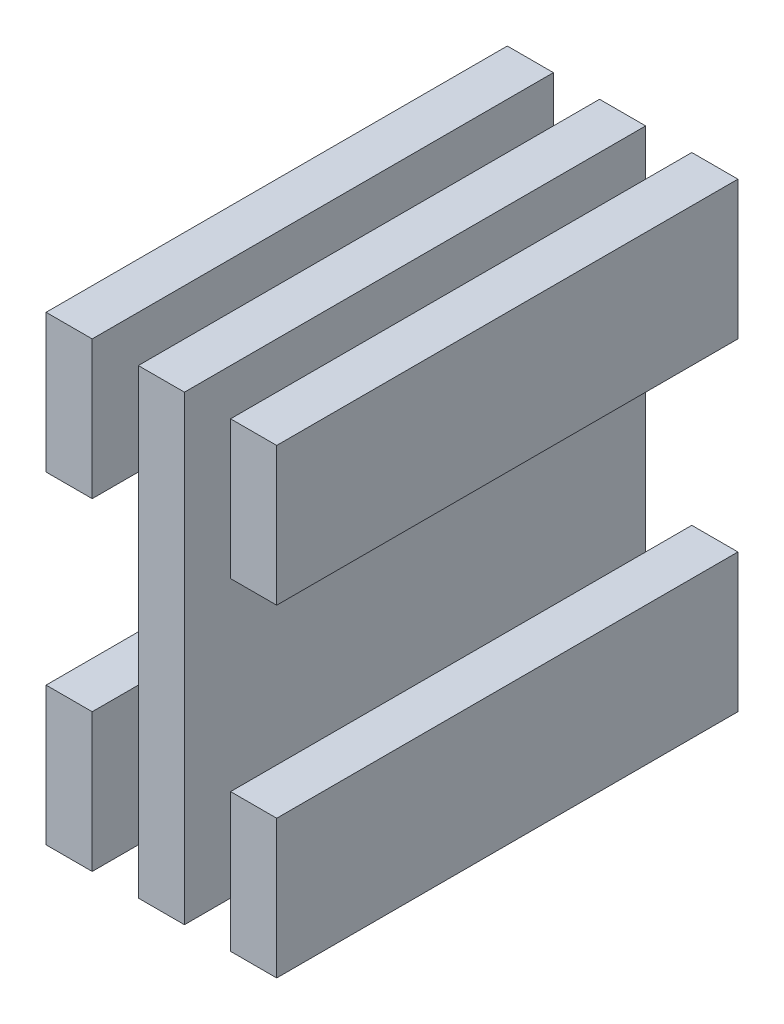
ISO-10303-21;
HEADER;
FILE_DESCRIPTION(('STEP AP214'),'2;1');
FILE_NAME('part.step','',(''),(''),'','','');
FILE_SCHEMA(('AUTOMOTIVE_DESIGN { 1 0 10303 214 1 1 1 1 }'));
ENDSEC;
DATA;
#1=APPLICATION_CONTEXT('core data for automotive mechanical design processes');
#2=APPLICATION_PROTOCOL_DEFINITION('international standard','automotive_design',2000,#1);
#3=PRODUCT_CONTEXT('',#1,'mechanical');
#4=PRODUCT('Part','Part','',(#3));
#5=PRODUCT_RELATED_PRODUCT_CATEGORY('part','',(#4));
#6=PRODUCT_DEFINITION_FORMATION('','',#4);
#7=PRODUCT_DEFINITION_CONTEXT('part definition',#1,'design');
#8=PRODUCT_DEFINITION('design','',#6,#7);
#9=PRODUCT_DEFINITION_SHAPE('','',#8);
#10=(LENGTH_UNIT() NAMED_UNIT(*) SI_UNIT(.MILLI.,.METRE.));
#11=(NAMED_UNIT(*) PLANE_ANGLE_UNIT() SI_UNIT($,.RADIAN.));
#12=(NAMED_UNIT(*) SI_UNIT($,.STERADIAN.) SOLID_ANGLE_UNIT());
#13=UNCERTAINTY_MEASURE_WITH_UNIT(LENGTH_MEASURE(1.E-05),#10,'distance_accuracy_value','');
#14=(GEOMETRIC_REPRESENTATION_CONTEXT(3) GLOBAL_UNCERTAINTY_ASSIGNED_CONTEXT((#13)) GLOBAL_UNIT_ASSIGNED_CONTEXT((#10,
#11,#12)) REPRESENTATION_CONTEXT('',''));
#15=CARTESIAN_POINT('',(0.,0.,0.));
#16=DIRECTION('',(0.,0.,1.));
#17=DIRECTION('',(1.,0.,0.));
#18=AXIS2_PLACEMENT_3D('',#15,#16,#17);
#19=CARTESIAN_POINT('',(0.,50.,-50.));
#20=DIRECTION('',(1.,0.,0.));
#21=DIRECTION('',(0.,0.,-1.));
#22=AXIS2_PLACEMENT_3D('',#19,#20,#21);
#23=PLANE('',#22);
#24=DIRECTION('',(0.,-1.,0.));
#25=VECTOR('',#24,1.);
#26=CARTESIAN_POINT('',(0.,50.,0.));
#27=LINE('',#26,#25);
#28=CARTESIAN_POINT('',(0.,15.,0.));
#29=VERTEX_POINT('',#28);
#30=CARTESIAN_POINT('',(0.,0.,0.));
#31=VERTEX_POINT('',#30);
#32=EDGE_CURVE('E93',#29,#31,#27,.T.);
#33=ORIENTED_EDGE('',*,*,#32,.F.);
#34=DIRECTION('',(0.,0.,-1.));
#35=VECTOR('',#34,1.);
#36=CARTESIAN_POINT('',(0.,15.,0.));
#37=LINE('',#36,#35);
#38=CARTESIAN_POINT('',(0.,15.,-50.));
#39=VERTEX_POINT('',#38);
#40=EDGE_CURVE('E82',#29,#39,#37,.T.);
#41=ORIENTED_EDGE('',*,*,#40,.T.);
#42=DIRECTION('',(0.,-1.,0.));
#43=VECTOR('',#42,1.);
#44=CARTESIAN_POINT('',(0.,50.,-50.));
#45=LINE('',#44,#43);
#46=CARTESIAN_POINT('',(0.,0.,-50.));
#47=VERTEX_POINT('',#46);
#48=EDGE_CURVE('E49',#39,#47,#45,.T.);
#49=ORIENTED_EDGE('',*,*,#48,.T.);
#50=DIRECTION('',(0.,0.,1.));
#51=VECTOR('',#50,1.);
#52=CARTESIAN_POINT('',(0.,0.,-50.));
#53=LINE('',#52,#51);
#54=EDGE_CURVE('E98',#47,#31,#53,.T.);
#55=ORIENTED_EDGE('',*,*,#54,.T.);
#56=EDGE_LOOP('',(#33,#41,#49,#55));
#57=FACE_BOUND('',#56,.T.);
#58=ADVANCED_FACE('F46',(#57),#23,.F.);
#59=CARTESIAN_POINT('',(0.,50.,0.));
#60=DIRECTION('',(0.,0.,-1.));
#61=DIRECTION('',(-1.,0.,0.));
#62=AXIS2_PLACEMENT_3D('',#59,#60,#61);
#63=PLANE('',#62);
#64=DIRECTION('',(0.,-1.,0.));
#65=VECTOR('',#64,1.);
#66=CARTESIAN_POINT('',(5.,50.,0.));
#67=LINE('',#66,#65);
#68=CARTESIAN_POINT('',(5.,15.,0.));
#69=VERTEX_POINT('',#68);
#70=CARTESIAN_POINT('',(5.,0.,0.));
#71=VERTEX_POINT('',#70);
#72=EDGE_CURVE('E95',#69,#71,#67,.T.);
#73=ORIENTED_EDGE('',*,*,#72,.F.);
#74=DIRECTION('',(1.,0.,0.));
#75=VECTOR('',#74,1.);
#76=CARTESIAN_POINT('',(0.,15.,0.));
#77=LINE('',#76,#75);
#78=EDGE_CURVE('E12',#29,#69,#77,.T.);
#79=ORIENTED_EDGE('',*,*,#78,.F.);
#80=ORIENTED_EDGE('',*,*,#32,.T.);
#81=DIRECTION('',(1.,0.,0.));
#82=VECTOR('',#81,1.);
#83=CARTESIAN_POINT('',(0.,0.,0.));
#84=LINE('',#83,#82);
#85=EDGE_CURVE('E99',#31,#71,#84,.T.);
#86=ORIENTED_EDGE('',*,*,#85,.T.);
#87=EDGE_LOOP('',(#73,#79,#80,#86));
#88=FACE_BOUND('',#87,.T.);
#89=ADVANCED_FACE('F91',(#88),#63,.F.);
#90=CARTESIAN_POINT('',(5.,50.,-50.));
#91=DIRECTION('',(-1.,0.,0.));
#92=DIRECTION('',(0.,0.,1.));
#93=AXIS2_PLACEMENT_3D('',#90,#91,#92);
#94=PLANE('',#93);
#95=DIRECTION('',(0.,-1.,0.));
#96=VECTOR('',#95,1.);
#97=CARTESIAN_POINT('',(5.,50.,-50.));
#98=LINE('',#97,#96);
#99=CARTESIAN_POINT('',(5.,15.,-50.));
#100=VERTEX_POINT('',#99);
#101=CARTESIAN_POINT('',(5.,0.,-50.));
#102=VERTEX_POINT('',#101);
#103=EDGE_CURVE('E106',#100,#102,#98,.T.);
#104=ORIENTED_EDGE('',*,*,#103,.F.);
#105=DIRECTION('',(0.,0.,1.));
#106=VECTOR('',#105,1.);
#107=CARTESIAN_POINT('',(5.,15.,-50.));
#108=LINE('',#107,#106);
#109=EDGE_CURVE('E63',#100,#69,#108,.T.);
#110=ORIENTED_EDGE('',*,*,#109,.T.);
#111=ORIENTED_EDGE('',*,*,#72,.T.);
#112=DIRECTION('',(0.,0.,-1.));
#113=VECTOR('',#112,1.);
#114=CARTESIAN_POINT('',(5.,0.,-50.));
#115=LINE('',#114,#113);
#116=EDGE_CURVE('E105',#71,#102,#115,.T.);
#117=ORIENTED_EDGE('',*,*,#116,.T.);
#118=EDGE_LOOP('',(#104,#110,#111,#117));
#119=FACE_BOUND('',#118,.T.);
#120=ADVANCED_FACE('F115',(#119),#94,.F.);
#121=CARTESIAN_POINT('',(0.,50.,-50.));
#122=DIRECTION('',(0.,0.,1.));
#123=DIRECTION('',(1.,0.,0.));
#124=AXIS2_PLACEMENT_3D('',#121,#122,#123);
#125=PLANE('',#124);
#126=ORIENTED_EDGE('',*,*,#48,.F.);
#127=DIRECTION('',(1.,0.,0.));
#128=VECTOR('',#127,1.);
#129=CARTESIAN_POINT('',(0.,15.,-50.));
#130=LINE('',#129,#128);
#131=EDGE_CURVE('E80',#39,#100,#130,.T.);
#132=ORIENTED_EDGE('',*,*,#131,.T.);
#133=ORIENTED_EDGE('',*,*,#103,.T.);
#134=DIRECTION('',(-1.,0.,0.));
#135=VECTOR('',#134,1.);
#136=CARTESIAN_POINT('',(0.,0.,-50.));
#137=LINE('',#136,#135);
#138=EDGE_CURVE('E55',#102,#47,#137,.T.);
#139=ORIENTED_EDGE('',*,*,#138,.T.);
#140=EDGE_LOOP('',(#126,#132,#133,#139));
#141=FACE_BOUND('',#140,.T.);
#142=ADVANCED_FACE('F120',(#141),#125,.F.);
#143=CARTESIAN_POINT('',(0.,0.,0.));
#144=DIRECTION('',(0.,1.,0.));
#145=DIRECTION('',(0.,0.,1.));
#146=AXIS2_PLACEMENT_3D('',#143,#144,#145);
#147=PLANE('',#146);
#148=ORIENTED_EDGE('',*,*,#54,.F.);
#149=ORIENTED_EDGE('',*,*,#138,.F.);
#150=ORIENTED_EDGE('',*,*,#116,.F.);
#151=ORIENTED_EDGE('',*,*,#85,.F.);
#152=EDGE_LOOP('',(#148,#149,#150,#151));
#153=FACE_BOUND('',#152,.T.);
#154=ADVANCED_FACE('F119',(#153),#147,.F.);
#155=CARTESIAN_POINT('',(0.,15.,0.));
#156=DIRECTION('',(0.,-1.,0.));
#157=DIRECTION('',(0.,0.,-1.));
#158=AXIS2_PLACEMENT_3D('',#155,#156,#157);
#159=PLANE('',#158);
#160=ORIENTED_EDGE('',*,*,#131,.F.);
#161=ORIENTED_EDGE('',*,*,#40,.F.);
#162=ORIENTED_EDGE('',*,*,#78,.T.);
#163=ORIENTED_EDGE('',*,*,#109,.F.);
#164=EDGE_LOOP('',(#160,#161,#162,#163));
#165=FACE_BOUND('',#164,.T.);
#166=ADVANCED_FACE('F84',(#165),#159,.F.);
#167=CLOSED_SHELL('',(#58,#89,#120,#142,#154,#166));
#168=MANIFOLD_SOLID_BREP('B2',#167);
#169=CARTESIAN_POINT('',(20.,50.,-50.));
#170=DIRECTION('',(0.,0.,1.));
#171=DIRECTION('',(1.,0.,0.));
#172=AXIS2_PLACEMENT_3D('',#169,#170,#171);
#173=PLANE('',#172);
#174=DIRECTION('',(0.,-1.,0.));
#175=VECTOR('',#174,1.);
#176=CARTESIAN_POINT('',(20.,50.,-50.));
#177=LINE('',#176,#175);
#178=CARTESIAN_POINT('',(20.,15.,-50.));
#179=VERTEX_POINT('',#178);
#180=CARTESIAN_POINT('',(20.,0.,-50.));
#181=VERTEX_POINT('',#180);
#182=EDGE_CURVE('E225',#179,#181,#177,.T.);
#183=ORIENTED_EDGE('',*,*,#182,.F.);
#184=DIRECTION('',(1.,0.,0.));
#185=VECTOR('',#184,1.);
#186=CARTESIAN_POINT('',(0.,15.,-50.));
#187=LINE('',#186,#185);
#188=CARTESIAN_POINT('',(25.,15.,-50.));
#189=VERTEX_POINT('',#188);
#190=EDGE_CURVE('E217',#179,#189,#187,.T.);
#191=ORIENTED_EDGE('',*,*,#190,.T.);
#192=DIRECTION('',(0.,-1.,0.));
#193=VECTOR('',#192,1.);
#194=CARTESIAN_POINT('',(25.,50.,-50.));
#195=LINE('',#194,#193);
#196=CARTESIAN_POINT('',(25.,0.,-50.));
#197=VERTEX_POINT('',#196);
#198=EDGE_CURVE('E183',#189,#197,#195,.T.);
#199=ORIENTED_EDGE('',*,*,#198,.T.);
#200=DIRECTION('',(-1.,0.,0.));
#201=VECTOR('',#200,1.);
#202=CARTESIAN_POINT('',(20.,0.,-50.));
#203=LINE('',#202,#201);
#204=EDGE_CURVE('E231',#197,#181,#203,.T.);
#205=ORIENTED_EDGE('',*,*,#204,.T.);
#206=EDGE_LOOP('',(#183,#191,#199,#205));
#207=FACE_BOUND('',#206,.T.);
#208=ADVANCED_FACE('F180',(#207),#173,.F.);
#209=CARTESIAN_POINT('',(20.,50.,-50.));
#210=DIRECTION('',(1.,0.,0.));
#211=DIRECTION('',(0.,0.,-1.));
#212=AXIS2_PLACEMENT_3D('',#209,#210,#211);
#213=PLANE('',#212);
#214=DIRECTION('',(0.,-1.,0.));
#215=VECTOR('',#214,1.);
#216=CARTESIAN_POINT('',(20.,50.,0.));
#217=LINE('',#216,#215);
#218=CARTESIAN_POINT('',(20.,15.,0.));
#219=VERTEX_POINT('',#218);
#220=CARTESIAN_POINT('',(20.,0.,0.));
#221=VERTEX_POINT('',#220);
#222=EDGE_CURVE('E240',#219,#221,#217,.T.);
#223=ORIENTED_EDGE('',*,*,#222,.F.);
#224=DIRECTION('',(0.,0.,-1.));
#225=VECTOR('',#224,1.);
#226=CARTESIAN_POINT('',(20.,15.,-50.));
#227=LINE('',#226,#225);
#228=EDGE_CURVE('E197',#219,#179,#227,.T.);
#229=ORIENTED_EDGE('',*,*,#228,.T.);
#230=ORIENTED_EDGE('',*,*,#182,.T.);
#231=DIRECTION('',(0.,0.,1.));
#232=VECTOR('',#231,1.);
#233=CARTESIAN_POINT('',(20.,0.,-50.));
#234=LINE('',#233,#232);
#235=EDGE_CURVE('E235',#181,#221,#234,.T.);
#236=ORIENTED_EDGE('',*,*,#235,.T.);
#237=EDGE_LOOP('',(#223,#229,#230,#236));
#238=FACE_BOUND('',#237,.T.);
#239=ADVANCED_FACE('F254',(#238),#213,.F.);
#240=CARTESIAN_POINT('',(20.,50.,0.));
#241=DIRECTION('',(0.,0.,-1.));
#242=DIRECTION('',(-1.,0.,0.));
#243=AXIS2_PLACEMENT_3D('',#240,#241,#242);
#244=PLANE('',#243);
#245=DIRECTION('',(0.,-1.,0.));
#246=VECTOR('',#245,1.);
#247=CARTESIAN_POINT('',(25.,50.,0.));
#248=LINE('',#247,#246);
#249=CARTESIAN_POINT('',(25.,15.,0.));
#250=VERTEX_POINT('',#249);
#251=CARTESIAN_POINT('',(25.,0.,0.));
#252=VERTEX_POINT('',#251);
#253=EDGE_CURVE('E242',#250,#252,#248,.T.);
#254=ORIENTED_EDGE('',*,*,#253,.F.);
#255=DIRECTION('',(1.,0.,0.));
#256=VECTOR('',#255,1.);
#257=CARTESIAN_POINT('',(0.,15.,0.));
#258=LINE('',#257,#256);
#259=EDGE_CURVE('E189',#219,#250,#258,.T.);
#260=ORIENTED_EDGE('',*,*,#259,.F.);
#261=ORIENTED_EDGE('',*,*,#222,.T.);
#262=DIRECTION('',(1.,0.,0.));
#263=VECTOR('',#262,1.);
#264=CARTESIAN_POINT('',(20.,0.,0.));
#265=LINE('',#264,#263);
#266=EDGE_CURVE('E241',#221,#252,#265,.T.);
#267=ORIENTED_EDGE('',*,*,#266,.T.);
#268=EDGE_LOOP('',(#254,#260,#261,#267));
#269=FACE_BOUND('',#268,.T.);
#270=ADVANCED_FACE('F247',(#269),#244,.F.);
#271=CARTESIAN_POINT('',(25.,50.,-50.));
#272=DIRECTION('',(-1.,0.,0.));
#273=DIRECTION('',(0.,0.,1.));
#274=AXIS2_PLACEMENT_3D('',#271,#272,#273);
#275=PLANE('',#274);
#276=ORIENTED_EDGE('',*,*,#198,.F.);
#277=DIRECTION('',(0.,0.,-1.));
#278=VECTOR('',#277,1.);
#279=CARTESIAN_POINT('',(25.,15.,0.));
#280=LINE('',#279,#278);
#281=EDGE_CURVE('E44',#250,#189,#280,.T.);
#282=ORIENTED_EDGE('',*,*,#281,.F.);
#283=ORIENTED_EDGE('',*,*,#253,.T.);
#284=DIRECTION('',(0.,0.,-1.));
#285=VECTOR('',#284,1.);
#286=CARTESIAN_POINT('',(25.,0.,-50.));
#287=LINE('',#286,#285);
#288=EDGE_CURVE('E229',#252,#197,#287,.T.);
#289=ORIENTED_EDGE('',*,*,#288,.T.);
#290=EDGE_LOOP('',(#276,#282,#283,#289));
#291=FACE_BOUND('',#290,.T.);
#292=ADVANCED_FACE('F227',(#291),#275,.F.);
#293=CARTESIAN_POINT('',(0.,0.,0.));
#294=DIRECTION('',(0.,-1.,0.));
#295=DIRECTION('',(0.,0.,-1.));
#296=AXIS2_PLACEMENT_3D('',#293,#294,#295);
#297=PLANE('',#296);
#298=ORIENTED_EDGE('',*,*,#204,.F.);
#299=ORIENTED_EDGE('',*,*,#288,.F.);
#300=ORIENTED_EDGE('',*,*,#266,.F.);
#301=ORIENTED_EDGE('',*,*,#235,.F.);
#302=EDGE_LOOP('',(#298,#299,#300,#301));
#303=FACE_BOUND('',#302,.T.);
#304=ADVANCED_FACE('F252',(#303),#297,.T.);
#305=CARTESIAN_POINT('',(0.,15.,0.));
#306=DIRECTION('',(0.,-1.,0.));
#307=DIRECTION('',(0.,0.,-1.));
#308=AXIS2_PLACEMENT_3D('',#305,#306,#307);
#309=PLANE('',#308);
#310=ORIENTED_EDGE('',*,*,#259,.T.);
#311=ORIENTED_EDGE('',*,*,#281,.T.);
#312=ORIENTED_EDGE('',*,*,#190,.F.);
#313=ORIENTED_EDGE('',*,*,#228,.F.);
#314=EDGE_LOOP('',(#310,#311,#312,#313));
#315=FACE_BOUND('',#314,.T.);
#316=ADVANCED_FACE('F216',(#315),#309,.F.);
#317=CLOSED_SHELL('',(#208,#239,#270,#292,#304,#316));
#318=MANIFOLD_SOLID_BREP('B6',#317);
#319=CARTESIAN_POINT('',(0.,50.,0.));
#320=DIRECTION('',(0.,-1.,0.));
#321=DIRECTION('',(0.,0.,-1.));
#322=AXIS2_PLACEMENT_3D('',#319,#320,#321);
#323=PLANE('',#322);
#324=DIRECTION('',(-1.,0.,0.));
#325=VECTOR('',#324,1.);
#326=CARTESIAN_POINT('',(20.,50.,-50.));
#327=LINE('',#326,#325);
#328=CARTESIAN_POINT('',(25.,50.,-50.));
#329=VERTEX_POINT('',#328);
#330=CARTESIAN_POINT('',(20.,50.,-50.));
#331=VERTEX_POINT('',#330);
#332=EDGE_CURVE('E381',#329,#331,#327,.T.);
#333=ORIENTED_EDGE('',*,*,#332,.T.);
#334=DIRECTION('',(0.,0.,1.));
#335=VECTOR('',#334,1.);
#336=CARTESIAN_POINT('',(20.,50.,-50.));
#337=LINE('',#336,#335);
#338=CARTESIAN_POINT('',(20.,50.,0.));
#339=VERTEX_POINT('',#338);
#340=EDGE_CURVE('E379',#331,#339,#337,.T.);
#341=ORIENTED_EDGE('',*,*,#340,.T.);
#342=DIRECTION('',(1.,0.,0.));
#343=VECTOR('',#342,1.);
#344=CARTESIAN_POINT('',(20.,50.,0.));
#345=LINE('',#344,#343);
#346=CARTESIAN_POINT('',(25.,50.,0.));
#347=VERTEX_POINT('',#346);
#348=EDGE_CURVE('E377',#339,#347,#345,.T.);
#349=ORIENTED_EDGE('',*,*,#348,.T.);
#350=DIRECTION('',(0.,0.,-1.));
#351=VECTOR('',#350,1.);
#352=CARTESIAN_POINT('',(25.,50.,-50.));
#353=LINE('',#352,#351);
#354=EDGE_CURVE('E337',#347,#329,#353,.T.);
#355=ORIENTED_EDGE('',*,*,#354,.T.);
#356=EDGE_LOOP('',(#333,#341,#349,#355));
#357=FACE_BOUND('',#356,.T.);
#358=ADVANCED_FACE('F314',(#357),#323,.F.);
#359=CARTESIAN_POINT('',(25.,50.,-50.));
#360=DIRECTION('',(-1.,0.,0.));
#361=DIRECTION('',(0.,0.,1.));
#362=AXIS2_PLACEMENT_3D('',#359,#360,#361);
#363=PLANE('',#362);
#364=DIRECTION('',(0.,-1.,0.));
#365=VECTOR('',#364,1.);
#366=CARTESIAN_POINT('',(25.,50.,0.));
#367=LINE('',#366,#365);
#368=CARTESIAN_POINT('',(25.,35.,0.));
#369=VERTEX_POINT('',#368);
#370=EDGE_CURVE('E367',#347,#369,#367,.T.);
#371=ORIENTED_EDGE('',*,*,#370,.T.);
#372=DIRECTION('',(0.,0.,1.));
#373=VECTOR('',#372,1.);
#374=CARTESIAN_POINT('',(25.,35.,0.));
#375=LINE('',#374,#373);
#376=CARTESIAN_POINT('',(25.,35.,-50.));
#377=VERTEX_POINT('',#376);
#378=EDGE_CURVE('E353',#377,#369,#375,.T.);
#379=ORIENTED_EDGE('',*,*,#378,.F.);
#380=DIRECTION('',(0.,-1.,0.));
#381=VECTOR('',#380,1.);
#382=CARTESIAN_POINT('',(25.,50.,-50.));
#383=LINE('',#382,#381);
#384=EDGE_CURVE('E372',#329,#377,#383,.T.);
#385=ORIENTED_EDGE('',*,*,#384,.F.);
#386=ORIENTED_EDGE('',*,*,#354,.F.);
#387=EDGE_LOOP('',(#371,#379,#385,#386));
#388=FACE_BOUND('',#387,.T.);
#389=ADVANCED_FACE('F371',(#388),#363,.F.);
#390=CARTESIAN_POINT('',(20.,50.,0.));
#391=DIRECTION('',(0.,0.,-1.));
#392=DIRECTION('',(-1.,0.,0.));
#393=AXIS2_PLACEMENT_3D('',#390,#391,#392);
#394=PLANE('',#393);
#395=DIRECTION('',(0.,-1.,0.));
#396=VECTOR('',#395,1.);
#397=CARTESIAN_POINT('',(20.,50.,0.));
#398=LINE('',#397,#396);
#399=CARTESIAN_POINT('',(20.,35.,0.));
#400=VERTEX_POINT('',#399);
#401=EDGE_CURVE('E322',#339,#400,#398,.T.);
#402=ORIENTED_EDGE('',*,*,#401,.T.);
#403=DIRECTION('',(1.,0.,0.));
#404=VECTOR('',#403,1.);
#405=CARTESIAN_POINT('',(0.,35.,0.));
#406=LINE('',#405,#404);
#407=EDGE_CURVE('E356',#400,#369,#406,.T.);
#408=ORIENTED_EDGE('',*,*,#407,.T.);
#409=ORIENTED_EDGE('',*,*,#370,.F.);
#410=ORIENTED_EDGE('',*,*,#348,.F.);
#411=EDGE_LOOP('',(#402,#408,#409,#410));
#412=FACE_BOUND('',#411,.T.);
#413=ADVANCED_FACE('F365',(#412),#394,.F.);
#414=CARTESIAN_POINT('',(20.,50.,-50.));
#415=DIRECTION('',(1.,0.,0.));
#416=DIRECTION('',(0.,0.,-1.));
#417=AXIS2_PLACEMENT_3D('',#414,#415,#416);
#418=PLANE('',#417);
#419=DIRECTION('',(0.,-1.,0.));
#420=VECTOR('',#419,1.);
#421=CARTESIAN_POINT('',(20.,50.,-50.));
#422=LINE('',#421,#420);
#423=CARTESIAN_POINT('',(20.,35.,-50.));
#424=VERTEX_POINT('',#423);
#425=EDGE_CURVE('E178',#331,#424,#422,.T.);
#426=ORIENTED_EDGE('',*,*,#425,.T.);
#427=DIRECTION('',(0.,0.,1.));
#428=VECTOR('',#427,1.);
#429=CARTESIAN_POINT('',(20.,35.,-50.));
#430=LINE('',#429,#428);
#431=EDGE_CURVE('E369',#424,#400,#430,.T.);
#432=ORIENTED_EDGE('',*,*,#431,.T.);
#433=ORIENTED_EDGE('',*,*,#401,.F.);
#434=ORIENTED_EDGE('',*,*,#340,.F.);
#435=EDGE_LOOP('',(#426,#432,#433,#434));
#436=FACE_BOUND('',#435,.T.);
#437=ADVANCED_FACE('F385',(#436),#418,.F.);
#438=CARTESIAN_POINT('',(20.,50.,-50.));
#439=DIRECTION('',(0.,0.,1.));
#440=DIRECTION('',(1.,0.,0.));
#441=AXIS2_PLACEMENT_3D('',#438,#439,#440);
#442=PLANE('',#441);
#443=ORIENTED_EDGE('',*,*,#384,.T.);
#444=DIRECTION('',(1.,0.,0.));
#445=VECTOR('',#444,1.);
#446=CARTESIAN_POINT('',(0.,35.,-50.));
#447=LINE('',#446,#445);
#448=EDGE_CURVE('E329',#424,#377,#447,.T.);
#449=ORIENTED_EDGE('',*,*,#448,.F.);
#450=ORIENTED_EDGE('',*,*,#425,.F.);
#451=ORIENTED_EDGE('',*,*,#332,.F.);
#452=EDGE_LOOP('',(#443,#449,#450,#451));
#453=FACE_BOUND('',#452,.T.);
#454=ADVANCED_FACE('F316',(#453),#442,.F.);
#455=CARTESIAN_POINT('',(0.,35.,0.));
#456=DIRECTION('',(0.,1.,0.));
#457=DIRECTION('',(0.,0.,1.));
#458=AXIS2_PLACEMENT_3D('',#455,#456,#457);
#459=PLANE('',#458);
#460=ORIENTED_EDGE('',*,*,#448,.T.);
#461=ORIENTED_EDGE('',*,*,#378,.T.);
#462=ORIENTED_EDGE('',*,*,#407,.F.);
#463=ORIENTED_EDGE('',*,*,#431,.F.);
#464=EDGE_LOOP('',(#460,#461,#462,#463));
#465=FACE_BOUND('',#464,.T.);
#466=ADVANCED_FACE('F355',(#465),#459,.F.);
#467=CLOSED_SHELL('',(#358,#389,#413,#437,#454,#466));
#468=MANIFOLD_SOLID_BREP('B38',#467);
#469=CARTESIAN_POINT('',(10.,50.,-50.));
#470=DIRECTION('',(0.,0.,1.));
#471=DIRECTION('',(1.,0.,0.));
#472=AXIS2_PLACEMENT_3D('',#469,#470,#471);
#473=PLANE('',#472);
#474=DIRECTION('',(-1.,0.,0.));
#475=VECTOR('',#474,1.);
#476=CARTESIAN_POINT('',(10.,0.,-50.));
#477=LINE('',#476,#475);
#478=CARTESIAN_POINT('',(15.,0.,-50.));
#479=VERTEX_POINT('',#478);
#480=CARTESIAN_POINT('',(10.,0.,-50.));
#481=VERTEX_POINT('',#480);
#482=EDGE_CURVE('E510',#479,#481,#477,.T.);
#483=ORIENTED_EDGE('',*,*,#482,.T.);
#484=DIRECTION('',(0.,-1.,0.));
#485=VECTOR('',#484,1.);
#486=CARTESIAN_POINT('',(10.,50.,-50.));
#487=LINE('',#486,#485);
#488=CARTESIAN_POINT('',(10.,50.,-50.));
#489=VERTEX_POINT('',#488);
#490=EDGE_CURVE('E312',#489,#481,#487,.T.);
#491=ORIENTED_EDGE('',*,*,#490,.F.);
#492=DIRECTION('',(-1.,0.,0.));
#493=VECTOR('',#492,1.);
#494=CARTESIAN_POINT('',(10.,50.,-50.));
#495=LINE('',#494,#493);
#496=CARTESIAN_POINT('',(15.,50.,-50.));
#497=VERTEX_POINT('',#496);
#498=EDGE_CURVE('E498',#497,#489,#495,.T.);
#499=ORIENTED_EDGE('',*,*,#498,.F.);
#500=DIRECTION('',(0.,-1.,0.));
#501=VECTOR('',#500,1.);
#502=CARTESIAN_POINT('',(15.,50.,-50.));
#503=LINE('',#502,#501);
#504=EDGE_CURVE('E506',#497,#479,#503,.T.);
#505=ORIENTED_EDGE('',*,*,#504,.T.);
#506=EDGE_LOOP('',(#483,#491,#499,#505));
#507=FACE_BOUND('',#506,.T.);
#508=ADVANCED_FACE('F447',(#507),#473,.F.);
#509=CARTESIAN_POINT('',(10.,50.,-50.));
#510=DIRECTION('',(1.,0.,0.));
#511=DIRECTION('',(0.,0.,-1.));
#512=AXIS2_PLACEMENT_3D('',#509,#510,#511);
#513=PLANE('',#512);
#514=DIRECTION('',(0.,0.,1.));
#515=VECTOR('',#514,1.);
#516=CARTESIAN_POINT('',(10.,0.,-50.));
#517=LINE('',#516,#515);
#518=CARTESIAN_POINT('',(10.,0.,0.));
#519=VERTEX_POINT('',#518);
#520=EDGE_CURVE('E502',#481,#519,#517,.T.);
#521=ORIENTED_EDGE('',*,*,#520,.T.);
#522=DIRECTION('',(0.,-1.,0.));
#523=VECTOR('',#522,1.);
#524=CARTESIAN_POINT('',(10.,50.,0.));
#525=LINE('',#524,#523);
#526=CARTESIAN_POINT('',(10.,50.,0.));
#527=VERTEX_POINT('',#526);
#528=EDGE_CURVE('E455',#527,#519,#525,.T.);
#529=ORIENTED_EDGE('',*,*,#528,.F.);
#530=DIRECTION('',(0.,0.,1.));
#531=VECTOR('',#530,1.);
#532=CARTESIAN_POINT('',(10.,50.,-50.));
#533=LINE('',#532,#531);
#534=EDGE_CURVE('E493',#489,#527,#533,.T.);
#535=ORIENTED_EDGE('',*,*,#534,.F.);
#536=ORIENTED_EDGE('',*,*,#490,.T.);
#537=EDGE_LOOP('',(#521,#529,#535,#536));
#538=FACE_BOUND('',#537,.T.);
#539=ADVANCED_FACE('F501',(#538),#513,.F.);
#540=CARTESIAN_POINT('',(10.,50.,0.));
#541=DIRECTION('',(0.,0.,-1.));
#542=DIRECTION('',(-1.,0.,0.));
#543=AXIS2_PLACEMENT_3D('',#540,#541,#542);
#544=PLANE('',#543);
#545=DIRECTION('',(1.,0.,0.));
#546=VECTOR('',#545,1.);
#547=CARTESIAN_POINT('',(10.,0.,0.));
#548=LINE('',#547,#546);
#549=CARTESIAN_POINT('',(15.,0.,0.));
#550=VERTEX_POINT('',#549);
#551=EDGE_CURVE('E480',#519,#550,#548,.T.);
#552=ORIENTED_EDGE('',*,*,#551,.T.);
#553=DIRECTION('',(0.,-1.,0.));
#554=VECTOR('',#553,1.);
#555=CARTESIAN_POINT('',(15.,50.,0.));
#556=LINE('',#555,#554);
#557=CARTESIAN_POINT('',(15.,50.,0.));
#558=VERTEX_POINT('',#557);
#559=EDGE_CURVE('E503',#558,#550,#556,.T.);
#560=ORIENTED_EDGE('',*,*,#559,.F.);
#561=DIRECTION('',(1.,0.,0.));
#562=VECTOR('',#561,1.);
#563=CARTESIAN_POINT('',(10.,50.,0.));
#564=LINE('',#563,#562);
#565=EDGE_CURVE('E496',#527,#558,#564,.T.);
#566=ORIENTED_EDGE('',*,*,#565,.F.);
#567=ORIENTED_EDGE('',*,*,#528,.T.);
#568=EDGE_LOOP('',(#552,#560,#566,#567));
#569=FACE_BOUND('',#568,.T.);
#570=ADVANCED_FACE('F504',(#569),#544,.F.);
#571=CARTESIAN_POINT('',(15.,50.,-50.));
#572=DIRECTION('',(-1.,0.,0.));
#573=DIRECTION('',(0.,0.,1.));
#574=AXIS2_PLACEMENT_3D('',#571,#572,#573);
#575=PLANE('',#574);
#576=DIRECTION('',(0.,0.,-1.));
#577=VECTOR('',#576,1.);
#578=CARTESIAN_POINT('',(15.,0.,-50.));
#579=LINE('',#578,#577);
#580=EDGE_CURVE('E486',#550,#479,#579,.T.);
#581=ORIENTED_EDGE('',*,*,#580,.T.);
#582=ORIENTED_EDGE('',*,*,#504,.F.);
#583=DIRECTION('',(0.,0.,-1.));
#584=VECTOR('',#583,1.);
#585=CARTESIAN_POINT('',(15.,50.,-50.));
#586=LINE('',#585,#584);
#587=EDGE_CURVE('E463',#558,#497,#586,.T.);
#588=ORIENTED_EDGE('',*,*,#587,.F.);
#589=ORIENTED_EDGE('',*,*,#559,.T.);
#590=EDGE_LOOP('',(#581,#582,#588,#589));
#591=FACE_BOUND('',#590,.T.);
#592=ADVANCED_FACE('F517',(#591),#575,.F.);
#593=CARTESIAN_POINT('',(0.,50.,0.));
#594=DIRECTION('',(0.,-1.,0.));
#595=DIRECTION('',(0.,0.,-1.));
#596=AXIS2_PLACEMENT_3D('',#593,#594,#595);
#597=PLANE('',#596);
#598=ORIENTED_EDGE('',*,*,#498,.T.);
#599=ORIENTED_EDGE('',*,*,#534,.T.);
#600=ORIENTED_EDGE('',*,*,#565,.T.);
#601=ORIENTED_EDGE('',*,*,#587,.T.);
#602=EDGE_LOOP('',(#598,#599,#600,#601));
#603=FACE_BOUND('',#602,.T.);
#604=ADVANCED_FACE('F494',(#603),#597,.F.);
#605=CARTESIAN_POINT('',(0.,0.,0.));
#606=DIRECTION('',(0.,-1.,0.));
#607=DIRECTION('',(0.,0.,-1.));
#608=AXIS2_PLACEMENT_3D('',#605,#606,#607);
#609=PLANE('',#608);
#610=ORIENTED_EDGE('',*,*,#482,.F.);
#611=ORIENTED_EDGE('',*,*,#580,.F.);
#612=ORIENTED_EDGE('',*,*,#551,.F.);
#613=ORIENTED_EDGE('',*,*,#520,.F.);
#614=EDGE_LOOP('',(#610,#611,#612,#613));
#615=FACE_BOUND('',#614,.T.);
#616=ADVANCED_FACE('F520',(#615),#609,.T.);
#617=CLOSED_SHELL('',(#508,#539,#570,#592,#604,#616));
#618=MANIFOLD_SOLID_BREP('B172',#617);
#619=CARTESIAN_POINT('',(0.,50.,0.));
#620=DIRECTION('',(0.,1.,0.));
#621=DIRECTION('',(0.,0.,1.));
#622=AXIS2_PLACEMENT_3D('',#619,#620,#621);
#623=PLANE('',#622);
#624=DIRECTION('',(0.,0.,1.));
#625=VECTOR('',#624,1.);
#626=CARTESIAN_POINT('',(0.,50.,-50.));
#627=LINE('',#626,#625);
#628=CARTESIAN_POINT('',(0.,50.,-50.));
#629=VERTEX_POINT('',#628);
#630=CARTESIAN_POINT('',(0.,50.,0.));
#631=VERTEX_POINT('',#630);
#632=EDGE_CURVE('E630',#629,#631,#627,.T.);
#633=ORIENTED_EDGE('',*,*,#632,.T.);
#634=DIRECTION('',(1.,0.,0.));
#635=VECTOR('',#634,1.);
#636=CARTESIAN_POINT('',(0.,50.,0.));
#637=LINE('',#636,#635);
#638=CARTESIAN_POINT('',(5.,50.,0.));
#639=VERTEX_POINT('',#638);
#640=EDGE_CURVE('E627',#631,#639,#637,.T.);
#641=ORIENTED_EDGE('',*,*,#640,.T.);
#642=DIRECTION('',(0.,0.,-1.));
#643=VECTOR('',#642,1.);
#644=CARTESIAN_POINT('',(5.,50.,-50.));
#645=LINE('',#644,#643);
#646=CARTESIAN_POINT('',(5.,50.,-50.));
#647=VERTEX_POINT('',#646);
#648=EDGE_CURVE('E629',#639,#647,#645,.T.);
#649=ORIENTED_EDGE('',*,*,#648,.T.);
#650=DIRECTION('',(-1.,0.,0.));
#651=VECTOR('',#650,1.);
#652=CARTESIAN_POINT('',(0.,50.,-50.));
#653=LINE('',#652,#651);
#654=EDGE_CURVE('E594',#647,#629,#653,.T.);
#655=ORIENTED_EDGE('',*,*,#654,.T.);
#656=EDGE_LOOP('',(#633,#641,#649,#655));
#657=FACE_BOUND('',#656,.T.);
#658=ADVANCED_FACE('F571',(#657),#623,.T.);
#659=CARTESIAN_POINT('',(0.,50.,-50.));
#660=DIRECTION('',(0.,0.,1.));
#661=DIRECTION('',(1.,0.,0.));
#662=AXIS2_PLACEMENT_3D('',#659,#660,#661);
#663=PLANE('',#662);
#664=DIRECTION('',(0.,-1.,0.));
#665=VECTOR('',#664,1.);
#666=CARTESIAN_POINT('',(5.,50.,-50.));
#667=LINE('',#666,#665);
#668=CARTESIAN_POINT('',(5.,35.,-50.));
#669=VERTEX_POINT('',#668);
#670=EDGE_CURVE('E639',#647,#669,#667,.T.);
#671=ORIENTED_EDGE('',*,*,#670,.T.);
#672=DIRECTION('',(1.,0.,0.));
#673=VECTOR('',#672,1.);
#674=CARTESIAN_POINT('',(0.,35.,-50.));
#675=LINE('',#674,#673);
#676=CARTESIAN_POINT('',(0.,35.,-50.));
#677=VERTEX_POINT('',#676);
#678=EDGE_CURVE('E618',#677,#669,#675,.T.);
#679=ORIENTED_EDGE('',*,*,#678,.F.);
#680=DIRECTION('',(0.,-1.,0.));
#681=VECTOR('',#680,1.);
#682=CARTESIAN_POINT('',(0.,50.,-50.));
#683=LINE('',#682,#681);
#684=EDGE_CURVE('E624',#629,#677,#683,.T.);
#685=ORIENTED_EDGE('',*,*,#684,.F.);
#686=ORIENTED_EDGE('',*,*,#654,.F.);
#687=EDGE_LOOP('',(#671,#679,#685,#686));
#688=FACE_BOUND('',#687,.T.);
#689=ADVANCED_FACE('F645',(#688),#663,.F.);
#690=CARTESIAN_POINT('',(5.,50.,-50.));
#691=DIRECTION('',(-1.,0.,0.));
#692=DIRECTION('',(0.,0.,1.));
#693=AXIS2_PLACEMENT_3D('',#690,#691,#692);
#694=PLANE('',#693);
#695=DIRECTION('',(0.,-1.,0.));
#696=VECTOR('',#695,1.);
#697=CARTESIAN_POINT('',(5.,50.,0.));
#698=LINE('',#697,#696);
#699=CARTESIAN_POINT('',(5.,35.,0.));
#700=VERTEX_POINT('',#699);
#701=EDGE_CURVE('E579',#639,#700,#698,.T.);
#702=ORIENTED_EDGE('',*,*,#701,.T.);
#703=DIRECTION('',(0.,0.,-1.));
#704=VECTOR('',#703,1.);
#705=CARTESIAN_POINT('',(5.,35.,-50.));
#706=LINE('',#705,#704);
#707=EDGE_CURVE('E614',#700,#669,#706,.T.);
#708=ORIENTED_EDGE('',*,*,#707,.T.);
#709=ORIENTED_EDGE('',*,*,#670,.F.);
#710=ORIENTED_EDGE('',*,*,#648,.F.);
#711=EDGE_LOOP('',(#702,#708,#709,#710));
#712=FACE_BOUND('',#711,.T.);
#713=ADVANCED_FACE('F642',(#712),#694,.F.);
#714=CARTESIAN_POINT('',(0.,50.,0.));
#715=DIRECTION('',(0.,0.,-1.));
#716=DIRECTION('',(-1.,0.,0.));
#717=AXIS2_PLACEMENT_3D('',#714,#715,#716);
#718=PLANE('',#717);
#719=DIRECTION('',(0.,-1.,0.));
#720=VECTOR('',#719,1.);
#721=CARTESIAN_POINT('',(0.,50.,0.));
#722=LINE('',#721,#720);
#723=CARTESIAN_POINT('',(0.,35.,0.));
#724=VERTEX_POINT('',#723);
#725=EDGE_CURVE('E445',#631,#724,#722,.T.);
#726=ORIENTED_EDGE('',*,*,#725,.T.);
#727=DIRECTION('',(1.,0.,0.));
#728=VECTOR('',#727,1.);
#729=CARTESIAN_POINT('',(0.,35.,0.));
#730=LINE('',#729,#728);
#731=EDGE_CURVE('E611',#724,#700,#730,.T.);
#732=ORIENTED_EDGE('',*,*,#731,.T.);
#733=ORIENTED_EDGE('',*,*,#701,.F.);
#734=ORIENTED_EDGE('',*,*,#640,.F.);
#735=EDGE_LOOP('',(#726,#732,#733,#734));
#736=FACE_BOUND('',#735,.T.);
#737=ADVANCED_FACE('F626',(#736),#718,.F.);
#738=CARTESIAN_POINT('',(0.,50.,-50.));
#739=DIRECTION('',(1.,0.,0.));
#740=DIRECTION('',(0.,0.,-1.));
#741=AXIS2_PLACEMENT_3D('',#738,#739,#740);
#742=PLANE('',#741);
#743=ORIENTED_EDGE('',*,*,#684,.T.);
#744=DIRECTION('',(0.,0.,1.));
#745=VECTOR('',#744,1.);
#746=CARTESIAN_POINT('',(0.,35.,0.));
#747=LINE('',#746,#745);
#748=EDGE_CURVE('E586',#677,#724,#747,.T.);
#749=ORIENTED_EDGE('',*,*,#748,.T.);
#750=ORIENTED_EDGE('',*,*,#725,.F.);
#751=ORIENTED_EDGE('',*,*,#632,.F.);
#752=EDGE_LOOP('',(#743,#749,#750,#751));
#753=FACE_BOUND('',#752,.T.);
#754=ADVANCED_FACE('F573',(#753),#742,.F.);
#755=CARTESIAN_POINT('',(0.,35.,0.));
#756=DIRECTION('',(0.,1.,0.));
#757=DIRECTION('',(0.,0.,1.));
#758=AXIS2_PLACEMENT_3D('',#755,#756,#757);
#759=PLANE('',#758);
#760=ORIENTED_EDGE('',*,*,#731,.F.);
#761=ORIENTED_EDGE('',*,*,#748,.F.);
#762=ORIENTED_EDGE('',*,*,#678,.T.);
#763=ORIENTED_EDGE('',*,*,#707,.F.);
#764=EDGE_LOOP('',(#760,#761,#762,#763));
#765=FACE_BOUND('',#764,.T.);
#766=ADVANCED_FACE('F612',(#765),#759,.F.);
#767=CLOSED_SHELL('',(#658,#689,#713,#737,#754,#766));
#768=MANIFOLD_SOLID_BREP('B306',#767);
#769=ADVANCED_BREP_SHAPE_REPRESENTATION('',(#18,#168,#318,#468,#618,#768),#14);
#770=SHAPE_DEFINITION_REPRESENTATION(#9,#769);
ENDSEC;
END-ISO-10303-21;
